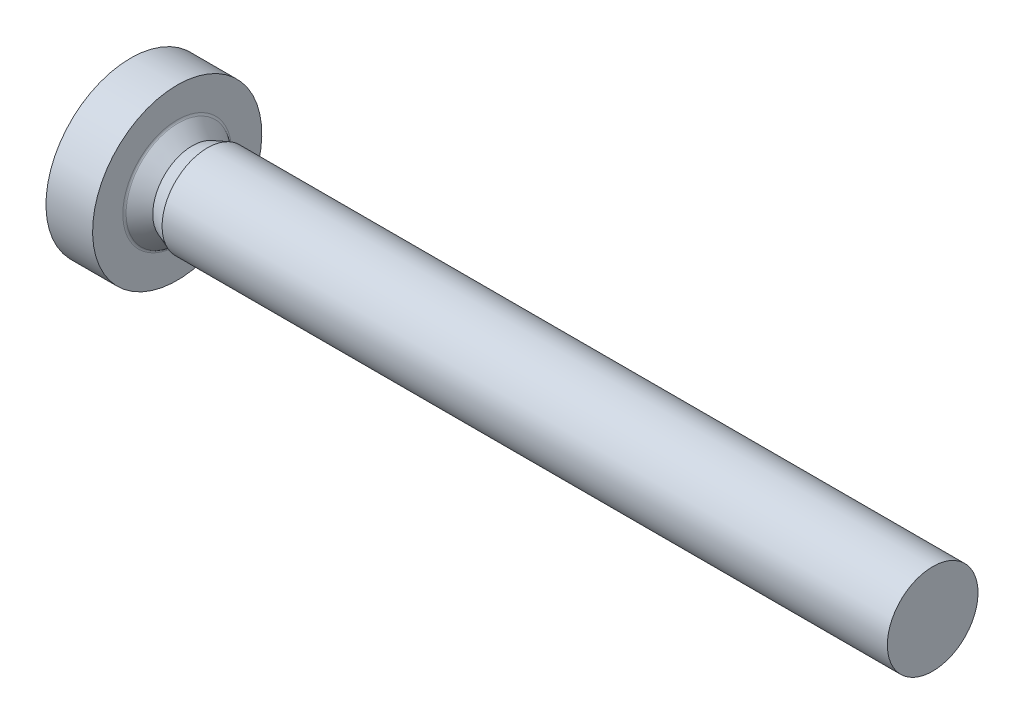
ISO-10303-21;
HEADER;
FILE_DESCRIPTION(('STEP AP214'),'2;1');
FILE_NAME('part.step','',(''),(''),'','','');
FILE_SCHEMA(('AUTOMOTIVE_DESIGN { 1 0 10303 214 1 1 1 1 }'));
ENDSEC;
DATA;
#1=APPLICATION_CONTEXT('core data for automotive mechanical design processes');
#2=APPLICATION_PROTOCOL_DEFINITION('international standard','automotive_design',2000,#1);
#3=PRODUCT_CONTEXT('',#1,'mechanical');
#4=PRODUCT('Part','Part','',(#3));
#5=PRODUCT_RELATED_PRODUCT_CATEGORY('part','',(#4));
#6=PRODUCT_DEFINITION_FORMATION('','',#4);
#7=PRODUCT_DEFINITION_CONTEXT('part definition',#1,'design');
#8=PRODUCT_DEFINITION('design','',#6,#7);
#9=PRODUCT_DEFINITION_SHAPE('','',#8);
#10=(LENGTH_UNIT() NAMED_UNIT(*) SI_UNIT(.MILLI.,.METRE.));
#11=(NAMED_UNIT(*) PLANE_ANGLE_UNIT() SI_UNIT($,.RADIAN.));
#12=(NAMED_UNIT(*) SI_UNIT($,.STERADIAN.) SOLID_ANGLE_UNIT());
#13=UNCERTAINTY_MEASURE_WITH_UNIT(LENGTH_MEASURE(1.E-05),#10,'distance_accuracy_value','');
#14=(GEOMETRIC_REPRESENTATION_CONTEXT(3) GLOBAL_UNCERTAINTY_ASSIGNED_CONTEXT((#13)) GLOBAL_UNIT_ASSIGNED_CONTEXT((#10,
#11,#12)) REPRESENTATION_CONTEXT('',''));
#15=CARTESIAN_POINT('',(0.,0.,0.));
#16=DIRECTION('',(0.,0.,1.));
#17=DIRECTION('',(1.,0.,0.));
#18=AXIS2_PLACEMENT_3D('',#15,#16,#17);
#19=CARTESIAN_POINT('',(25.,0.75,0.));
#20=DIRECTION('',(1.,0.,0.));
#21=DIRECTION('',(0.,1.,0.));
#22=AXIS2_PLACEMENT_3D('',#19,#20,#21);
#23=PLANE('',#22);
#24=CARTESIAN_POINT('',(25.,0.,0.));
#25=DIRECTION('',(1.,0.,0.));
#26=DIRECTION('',(0.,1.,0.));
#27=AXIS2_PLACEMENT_3D('',#24,#25,#26);
#28=CIRCLE('',#27,1.5);
#29=CARTESIAN_POINT('',(25.,1.5,0.));
#30=VERTEX_POINT('',#29);
#31=EDGE_CURVE('E11',#30,#30,#28,.T.);
#32=ORIENTED_EDGE('',*,*,#31,.T.);
#33=EDGE_LOOP('',(#32));
#34=FACE_BOUND('',#33,.T.);
#35=ADVANCED_FACE('F16',(#34),#23,.T.);
#36=CARTESIAN_POINT('',(13.,0.,0.));
#37=DIRECTION('',(-1.,0.,0.));
#38=DIRECTION('',(0.,1.,0.));
#39=AXIS2_PLACEMENT_3D('',#36,#37,#38);
#40=CYLINDRICAL_SURFACE('',#39,1.5);
#41=CARTESIAN_POINT('',(1.,0.,0.));
#42=DIRECTION('',(1.,0.,0.));
#43=DIRECTION('',(0.,1.,0.));
#44=AXIS2_PLACEMENT_3D('',#41,#42,#43);
#45=CIRCLE('',#44,1.5);
#46=CARTESIAN_POINT('',(1.,1.5,0.));
#47=VERTEX_POINT('',#46);
#48=EDGE_CURVE('E26',#47,#47,#45,.T.);
#49=ORIENTED_EDGE('',*,*,#48,.T.);
#50=EDGE_LOOP('',(#49));
#51=FACE_BOUND('',#50,.T.);
#52=ORIENTED_EDGE('',*,*,#31,.F.);
#53=EDGE_LOOP('',(#52));
#54=FACE_BOUND('',#53,.T.);
#55=ADVANCED_FACE('F393',(#51,#54),#40,.T.);
#56=CARTESIAN_POINT('',(0.75,0.,0.));
#57=DIRECTION('',(1.,0.,0.));
#58=DIRECTION('',(0.,1.,0.));
#59=AXIS2_PLACEMENT_3D('',#56,#57,#58);
#60=CONICAL_SURFACE('',#59,1.404375,0.365329745380521);
#61=CARTESIAN_POINT('',(0.5,0.,0.));
#62=DIRECTION('',(1.,0.,0.));
#63=DIRECTION('',(0.,1.,0.));
#64=AXIS2_PLACEMENT_3D('',#61,#62,#63);
#65=CIRCLE('',#64,1.30875);
#66=CARTESIAN_POINT('',(0.5,1.30875,0.));
#67=VERTEX_POINT('',#66);
#68=EDGE_CURVE('E268',#67,#67,#65,.T.);
#69=ORIENTED_EDGE('',*,*,#68,.T.);
#70=EDGE_LOOP('',(#69));
#71=FACE_BOUND('',#70,.T.);
#72=ORIENTED_EDGE('',*,*,#48,.F.);
#73=EDGE_LOOP('',(#72));
#74=FACE_BOUND('',#73,.T.);
#75=ADVANCED_FACE('F388',(#71,#74),#60,.T.);
#76=CARTESIAN_POINT('',(0.266697090928547,0.,0.));
#77=DIRECTION('',(-1.,0.,0.));
#78=DIRECTION('',(0.,1.,0.));
#79=AXIS2_PLACEMENT_3D('',#76,#77,#78);
#80=CONICAL_SURFACE('',#79,1.51708001042528,0.728911585355214);
#81=CARTESIAN_POINT('',(0.0333941818570964,0.,0.));
#82=DIRECTION('',(1.,0.,0.));
#83=DIRECTION('',(0.,1.,0.));
#84=AXIS2_PLACEMENT_3D('',#81,#82,#83);
#85=CIRCLE('',#84,1.72541002085056);
#86=CARTESIAN_POINT('',(0.0333941818570951,1.72541002085056,0.));
#87=VERTEX_POINT('',#86);
#88=EDGE_CURVE('E265',#87,#87,#85,.T.);
#89=ORIENTED_EDGE('',*,*,#88,.T.);
#90=EDGE_LOOP('',(#89));
#91=FACE_BOUND('',#90,.T.);
#92=ORIENTED_EDGE('',*,*,#68,.F.);
#93=EDGE_LOOP('',(#92));
#94=FACE_BOUND('',#93,.T.);
#95=ADVANCED_FACE('F372',(#91,#94),#80,.T.);
#96=CARTESIAN_POINT('',(0.1,0.,0.));
#97=DIRECTION('',(1.,0.,0.));
#98=DIRECTION('',(0.,0.,-1.));
#99=AXIS2_PLACEMENT_3D('',#96,#97,#98);
#100=TOROIDAL_SURFACE('',#99,1.8,0.1);
#101=CARTESIAN_POINT('',(0.,0.,0.));
#102=DIRECTION('',(1.,0.,0.));
#103=DIRECTION('',(0.,1.,0.));
#104=AXIS2_PLACEMENT_3D('',#101,#102,#103);
#105=CIRCLE('',#104,1.8);
#106=CARTESIAN_POINT('',(0.,1.8,0.));
#107=VERTEX_POINT('',#106);
#108=EDGE_CURVE('E269',#107,#107,#105,.T.);
#109=ORIENTED_EDGE('',*,*,#108,.T.);
#110=EDGE_LOOP('',(#109));
#111=FACE_BOUND('',#110,.T.);
#112=ORIENTED_EDGE('',*,*,#88,.F.);
#113=EDGE_LOOP('',(#112));
#114=FACE_BOUND('',#113,.T.);
#115=ADVANCED_FACE('F375',(#111,#114),#100,.F.);
#116=CARTESIAN_POINT('',(0.,2.3,0.));
#117=DIRECTION('',(1.,0.,0.));
#118=DIRECTION('',(0.,1.,0.));
#119=AXIS2_PLACEMENT_3D('',#116,#117,#118);
#120=PLANE('',#119);
#121=CARTESIAN_POINT('',(0.,0.,0.));
#122=DIRECTION('',(1.,0.,0.));
#123=DIRECTION('',(0.,1.,0.));
#124=AXIS2_PLACEMENT_3D('',#121,#122,#123);
#125=CIRCLE('',#124,2.8);
#126=CARTESIAN_POINT('',(0.,2.8,0.));
#127=VERTEX_POINT('',#126);
#128=EDGE_CURVE('E286',#127,#127,#125,.T.);
#129=ORIENTED_EDGE('',*,*,#128,.T.);
#130=EDGE_LOOP('',(#129));
#131=FACE_BOUND('',#130,.T.);
#132=ORIENTED_EDGE('',*,*,#108,.F.);
#133=EDGE_LOOP('',(#132));
#134=FACE_BOUND('',#133,.T.);
#135=ADVANCED_FACE('F377',(#131,#134),#120,.T.);
#136=CARTESIAN_POINT('',(-0.771231517720798,0.,0.));
#137=DIRECTION('',(-1.,0.,0.));
#138=DIRECTION('',(0.,1.,0.));
#139=AXIS2_PLACEMENT_3D('',#136,#137,#138);
#140=CYLINDRICAL_SURFACE('',#139,2.8);
#141=CARTESIAN_POINT('',(-1.54246303544159,0.,0.));
#142=DIRECTION('',(1.,0.,0.));
#143=DIRECTION('',(0.,1.,0.));
#144=AXIS2_PLACEMENT_3D('',#141,#142,#143);
#145=CIRCLE('',#144,2.8);
#146=CARTESIAN_POINT('',(-1.54246303544159,2.8,0.));
#147=VERTEX_POINT('',#146);
#148=EDGE_CURVE('E284',#147,#147,#145,.T.);
#149=ORIENTED_EDGE('',*,*,#148,.T.);
#150=EDGE_LOOP('',(#149));
#151=FACE_BOUND('',#150,.T.);
#152=ORIENTED_EDGE('',*,*,#128,.F.);
#153=EDGE_LOOP('',(#152));
#154=FACE_BOUND('',#153,.T.);
#155=ADVANCED_FACE('F385',(#151,#154),#140,.T.);
#156=CARTESIAN_POINT('',(2.6,0.,0.));
#157=DIRECTION('',(0.,0.,1.));
#158=DIRECTION('',(1.,0.,0.));
#159=AXIS2_PLACEMENT_3D('',#156,#157,#158);
#160=SPHERICAL_SURFACE('',#159,5.);
#161=ORIENTED_EDGE('',*,*,#148,.F.);
#162=EDGE_LOOP('',(#161));
#163=FACE_BOUND('',#162,.T.);
#164=CARTESIAN_POINT('',(2.6,1.5,0.));
#165=DIRECTION('',(0.,1.,0.));
#166=DIRECTION('',(0.,0.,-1.));
#167=AXIS2_PLACEMENT_3D('',#164,#165,#166);
#168=CIRCLE('',#167,4.76969600708473);
#169=CARTESIAN_POINT('',(-2.16025209416476,1.5,-0.3));
#170=VERTEX_POINT('',#169);
#171=CARTESIAN_POINT('',(-2.16025209416476,1.5,0.3));
#172=VERTEX_POINT('',#171);
#173=EDGE_CURVE('E283',#170,#172,#168,.T.);
#174=ORIENTED_EDGE('',*,*,#173,.T.);
#175=CARTESIAN_POINT('',(2.6,-0.0146530414091956,0.167485029701634));
#176=DIRECTION('',(0.,-0.0871557427476582,0.996194698091746));
#177=DIRECTION('',(0.,0.996194698091746,0.0871557427476581));
#178=AXIS2_PLACEMENT_3D('',#175,#176,#177);
#179=CIRCLE('',#178,4.99717260590459);
#180=CARTESIAN_POINT('',(-2.35893576512593,0.6,0.221260202826669));
#181=VERTEX_POINT('',#180);
#182=EDGE_CURVE('E222',#172,#181,#179,.T.);
#183=ORIENTED_EDGE('',*,*,#182,.T.);
#184=CARTESIAN_POINT('',(2.6,0.245808478247197,0.425752773255334));
#185=DIRECTION('',(0.,0.5,0.866025403784438));
#186=DIRECTION('',(0.,0.866025403784438,-0.5));
#187=AXIS2_PLACEMENT_3D('',#184,#185,#186);
#188=CIRCLE('',#187,4.97577258002083);
#189=CARTESIAN_POINT('',(-2.374028589137,0.359888590016273,0.359888590016274));
#190=VERTEX_POINT('',#189);
#191=EDGE_CURVE('E228',#181,#190,#188,.T.);
#192=ORIENTED_EDGE('',*,*,#191,.T.);
#193=CARTESIAN_POINT('',(2.6,0.425752773255333,0.245808478247197));
#194=DIRECTION('',(0.,0.866025403784439,0.5));
#195=DIRECTION('',(0.,0.5,-0.866025403784439));
#196=AXIS2_PLACEMENT_3D('',#193,#194,#195);
#197=CIRCLE('',#196,4.97577258002083);
#198=CARTESIAN_POINT('',(-2.35893576512593,0.221260202826669,0.6));
#199=VERTEX_POINT('',#198);
#200=EDGE_CURVE('E211',#190,#199,#197,.T.);
#201=ORIENTED_EDGE('',*,*,#200,.T.);
#202=CARTESIAN_POINT('',(2.6,0.167485029701634,-0.0146530414091956));
#203=DIRECTION('',(0.,0.996194698091746,-0.0871557427476583));
#204=DIRECTION('',(0.,-0.0871557427476583,-0.996194698091746));
#205=AXIS2_PLACEMENT_3D('',#202,#203,#204);
#206=CIRCLE('',#205,4.99717260590459);
#207=CARTESIAN_POINT('',(-2.16025209416476,0.3,1.5));
#208=VERTEX_POINT('',#207);
#209=EDGE_CURVE('E212',#199,#208,#206,.T.);
#210=ORIENTED_EDGE('',*,*,#209,.T.);
#211=CARTESIAN_POINT('',(2.6,0.,1.5));
#212=DIRECTION('',(0.,0.,1.));
#213=DIRECTION('',(0.,1.,0.));
#214=AXIS2_PLACEMENT_3D('',#211,#212,#213);
#215=CIRCLE('',#214,4.76969600708473);
#216=CARTESIAN_POINT('',(-2.16025209416476,-0.3,1.5));
#217=VERTEX_POINT('',#216);
#218=EDGE_CURVE('E258',#208,#217,#215,.T.);
#219=ORIENTED_EDGE('',*,*,#218,.T.);
#220=CARTESIAN_POINT('',(2.6,-0.167485029701634,-0.0146530414091956));
#221=DIRECTION('',(0.,-0.996194698091746,-0.0871557427476581));
#222=DIRECTION('',(0.,-0.0871557427476581,0.996194698091746));
#223=AXIS2_PLACEMENT_3D('',#220,#221,#222);
#224=CIRCLE('',#223,4.99717260590459);
#225=CARTESIAN_POINT('',(-2.35893576512593,-0.221260202826669,0.6));
#226=VERTEX_POINT('',#225);
#227=EDGE_CURVE('E257',#217,#226,#224,.T.);
#228=ORIENTED_EDGE('',*,*,#227,.T.);
#229=CARTESIAN_POINT('',(2.6,-0.425752773255333,0.245808478247197));
#230=DIRECTION('',(0.,-0.866025403784439,0.5));
#231=DIRECTION('',(0.,0.5,0.866025403784439));
#232=AXIS2_PLACEMENT_3D('',#229,#230,#231);
#233=CIRCLE('',#232,4.97577258002083);
#234=CARTESIAN_POINT('',(-2.374028589137,-0.359888590016273,0.359888590016274));
#235=VERTEX_POINT('',#234);
#236=EDGE_CURVE('E179',#226,#235,#233,.T.);
#237=ORIENTED_EDGE('',*,*,#236,.T.);
#238=CARTESIAN_POINT('',(2.6,-0.245808478247197,0.425752773255334));
#239=DIRECTION('',(0.,-0.5,0.866025403784439));
#240=DIRECTION('',(0.,0.866025403784439,0.5));
#241=AXIS2_PLACEMENT_3D('',#238,#239,#240);
#242=CIRCLE('',#241,4.97577258002083);
#243=CARTESIAN_POINT('',(-2.35893576512593,-0.6,0.221260202826669));
#244=VERTEX_POINT('',#243);
#245=EDGE_CURVE('E170',#235,#244,#242,.T.);
#246=ORIENTED_EDGE('',*,*,#245,.T.);
#247=CARTESIAN_POINT('',(2.6,0.0146530414091956,0.167485029701634));
#248=DIRECTION('',(0.,0.0871557427476581,0.996194698091746));
#249=DIRECTION('',(0.,0.996194698091746,-0.0871557427476581));
#250=AXIS2_PLACEMENT_3D('',#247,#248,#249);
#251=CIRCLE('',#250,4.99717260590459);
#252=CARTESIAN_POINT('',(-2.16025209416476,-1.5,0.3));
#253=VERTEX_POINT('',#252);
#254=EDGE_CURVE('E176',#244,#253,#251,.T.);
#255=ORIENTED_EDGE('',*,*,#254,.T.);
#256=CARTESIAN_POINT('',(2.6,-1.5,0.));
#257=DIRECTION('',(0.,-1.,0.));
#258=DIRECTION('',(0.,0.,1.));
#259=AXIS2_PLACEMENT_3D('',#256,#257,#258);
#260=CIRCLE('',#259,4.76969600708473);
#261=CARTESIAN_POINT('',(-2.16025209416476,-1.5,-0.3));
#262=VERTEX_POINT('',#261);
#263=EDGE_CURVE('E350',#253,#262,#260,.T.);
#264=ORIENTED_EDGE('',*,*,#263,.T.);
#265=CARTESIAN_POINT('',(2.6,0.0146530414091956,-0.167485029701634));
#266=DIRECTION('',(0.,0.087155742747658,-0.996194698091746));
#267=DIRECTION('',(0.,-0.996194698091746,-0.087155742747658));
#268=AXIS2_PLACEMENT_3D('',#265,#266,#267);
#269=CIRCLE('',#268,4.99717260590459);
#270=CARTESIAN_POINT('',(-2.35893576512593,-0.6,-0.221260202826669));
#271=VERTEX_POINT('',#270);
#272=EDGE_CURVE('E274',#262,#271,#269,.T.);
#273=ORIENTED_EDGE('',*,*,#272,.T.);
#274=CARTESIAN_POINT('',(2.6,-0.245808478247196,-0.425752773255333));
#275=DIRECTION('',(0.,-0.5,-0.866025403784439));
#276=DIRECTION('',(0.,-0.866025403784439,0.5));
#277=AXIS2_PLACEMENT_3D('',#274,#275,#276);
#278=CIRCLE('',#277,4.97577258002083);
#279=CARTESIAN_POINT('',(-2.374028589137,-0.359888590016273,-0.359888590016273));
#280=VERTEX_POINT('',#279);
#281=EDGE_CURVE('E251',#271,#280,#278,.T.);
#282=ORIENTED_EDGE('',*,*,#281,.T.);
#283=CARTESIAN_POINT('',(2.6,-0.425752773255333,-0.245808478247196));
#284=DIRECTION('',(0.,-0.866025403784439,-0.5));
#285=DIRECTION('',(0.,-0.5,0.866025403784439));
#286=AXIS2_PLACEMENT_3D('',#283,#284,#285);
#287=CIRCLE('',#286,4.97577258002083);
#288=CARTESIAN_POINT('',(-2.35893576512593,-0.221260202826669,-0.6));
#289=VERTEX_POINT('',#288);
#290=EDGE_CURVE('E299',#280,#289,#287,.T.);
#291=ORIENTED_EDGE('',*,*,#290,.T.);
#292=CARTESIAN_POINT('',(2.6,-0.167485029701634,0.0146530414091956));
#293=DIRECTION('',(0.,-0.996194698091746,0.0871557427476582));
#294=DIRECTION('',(0.,0.0871557427476582,0.996194698091746));
#295=AXIS2_PLACEMENT_3D('',#292,#293,#294);
#296=CIRCLE('',#295,4.99717260590459);
#297=CARTESIAN_POINT('',(-2.16025209416476,-0.3,-1.5));
#298=VERTEX_POINT('',#297);
#299=EDGE_CURVE('E90',#289,#298,#296,.T.);
#300=ORIENTED_EDGE('',*,*,#299,.T.);
#301=CARTESIAN_POINT('',(2.6,0.,-1.5));
#302=DIRECTION('',(0.,0.,-1.));
#303=DIRECTION('',(0.,-1.,0.));
#304=AXIS2_PLACEMENT_3D('',#301,#302,#303);
#305=CIRCLE('',#304,4.76969600708473);
#306=CARTESIAN_POINT('',(-2.16025209416476,0.3,-1.5));
#307=VERTEX_POINT('',#306);
#308=EDGE_CURVE('E313',#298,#307,#305,.T.);
#309=ORIENTED_EDGE('',*,*,#308,.T.);
#310=CARTESIAN_POINT('',(2.6,0.167485029701634,0.0146530414091956));
#311=DIRECTION('',(0.,0.996194698091746,0.0871557427476582));
#312=DIRECTION('',(0.,0.0871557427476582,-0.996194698091746));
#313=AXIS2_PLACEMENT_3D('',#310,#311,#312);
#314=CIRCLE('',#313,4.99717260590459);
#315=CARTESIAN_POINT('',(-2.35893576512593,0.221260202826669,-0.6));
#316=VERTEX_POINT('',#315);
#317=EDGE_CURVE('E238',#307,#316,#314,.T.);
#318=ORIENTED_EDGE('',*,*,#317,.T.);
#319=CARTESIAN_POINT('',(2.6,0.425752773255333,-0.245808478247196));
#320=DIRECTION('',(0.,0.866025403784439,-0.5));
#321=DIRECTION('',(0.,-0.5,-0.866025403784439));
#322=AXIS2_PLACEMENT_3D('',#319,#320,#321);
#323=CIRCLE('',#322,4.97577258002083);
#324=CARTESIAN_POINT('',(-2.374028589137,0.359888590016273,-0.359888590016274));
#325=VERTEX_POINT('',#324);
#326=EDGE_CURVE('E242',#316,#325,#323,.T.);
#327=ORIENTED_EDGE('',*,*,#326,.T.);
#328=CARTESIAN_POINT('',(2.6,0.245808478247196,-0.425752773255333));
#329=DIRECTION('',(0.,0.5,-0.866025403784439));
#330=DIRECTION('',(0.,-0.866025403784439,-0.5));
#331=AXIS2_PLACEMENT_3D('',#328,#329,#330);
#332=CIRCLE('',#331,4.97577258002083);
#333=CARTESIAN_POINT('',(-2.35893576512593,0.6,-0.221260202826669));
#334=VERTEX_POINT('',#333);
#335=EDGE_CURVE('E279',#325,#334,#332,.T.);
#336=ORIENTED_EDGE('',*,*,#335,.T.);
#337=CARTESIAN_POINT('',(2.6,-0.0146530414091956,-0.167485029701633));
#338=DIRECTION('',(0.,-0.0871557427476582,-0.996194698091746));
#339=DIRECTION('',(0.,-0.996194698091746,0.0871557427476582));
#340=AXIS2_PLACEMENT_3D('',#337,#338,#339);
#341=CIRCLE('',#340,4.99717260590459);
#342=EDGE_CURVE('E261',#334,#170,#341,.T.);
#343=ORIENTED_EDGE('',*,*,#342,.T.);
#344=EDGE_LOOP('',(#174,#183,#192,#201,#210,#219,#228,#237,#246,#255,#264,#273,#282,#291,#300,
#309,#318,#327,#336,#343));
#345=FACE_BOUND('',#344,.T.);
#346=ADVANCED_FACE('F173',(#163,#345),#160,.T.);
#347=CARTESIAN_POINT('',(-1.2,0.,0.));
#348=DIRECTION('',(1.,0.,0.));
#349=DIRECTION('',(0.,0.,-1.));
#350=AXIS2_PLACEMENT_3D('',#347,#348,#349);
#351=PLANE('',#350);
#352=DIRECTION('',(0.,0.,-1.));
#353=VECTOR('',#352,1.);
#354=CARTESIAN_POINT('',(-1.2,1.5,-0.3));
#355=LINE('',#354,#353);
#356=CARTESIAN_POINT('',(-1.2,1.5,0.3));
#357=VERTEX_POINT('',#356);
#358=CARTESIAN_POINT('',(-1.2,1.5,-0.3));
#359=VERTEX_POINT('',#358);
#360=EDGE_CURVE('E201',#357,#359,#355,.T.);
#361=ORIENTED_EDGE('',*,*,#360,.T.);
#362=DIRECTION('',(0.,-0.996194698091746,0.0871557427476582));
#363=VECTOR('',#362,1.);
#364=CARTESIAN_POINT('',(-1.2,1.5,-0.3));
#365=LINE('',#364,#363);
#366=CARTESIAN_POINT('',(-1.2,0.6,-0.221260202826669));
#367=VERTEX_POINT('',#366);
#368=EDGE_CURVE('E264',#359,#367,#365,.T.);
#369=ORIENTED_EDGE('',*,*,#368,.T.);
#370=DIRECTION('',(0.,-0.866025403784439,-0.5));
#371=VECTOR('',#370,1.);
#372=CARTESIAN_POINT('',(-1.2,0.6,-0.221260202826669));
#373=LINE('',#372,#371);
#374=CARTESIAN_POINT('',(-1.2,0.359888590016273,-0.359888590016273));
#375=VERTEX_POINT('',#374);
#376=EDGE_CURVE('E277',#367,#375,#373,.T.);
#377=ORIENTED_EDGE('',*,*,#376,.T.);
#378=DIRECTION('',(0.,-0.5,-0.866025403784439));
#379=VECTOR('',#378,1.);
#380=CARTESIAN_POINT('',(-1.2,0.221260202826669,-0.6));
#381=LINE('',#380,#379);
#382=CARTESIAN_POINT('',(-1.2,0.221260202826669,-0.6));
#383=VERTEX_POINT('',#382);
#384=EDGE_CURVE('E294',#375,#383,#381,.T.);
#385=ORIENTED_EDGE('',*,*,#384,.T.);
#386=DIRECTION('',(0.,0.0871557427476582,-0.996194698091746));
#387=VECTOR('',#386,1.);
#388=CARTESIAN_POINT('',(-1.2,0.3,-1.5));
#389=LINE('',#388,#387);
#390=CARTESIAN_POINT('',(-1.2,0.3,-1.5));
#391=VERTEX_POINT('',#390);
#392=EDGE_CURVE('E236',#383,#391,#389,.T.);
#393=ORIENTED_EDGE('',*,*,#392,.T.);
#394=DIRECTION('',(0.,-1.,0.));
#395=VECTOR('',#394,1.);
#396=CARTESIAN_POINT('',(-1.2,-0.3,-1.5));
#397=LINE('',#396,#395);
#398=CARTESIAN_POINT('',(-1.2,-0.3,-1.5));
#399=VERTEX_POINT('',#398);
#400=EDGE_CURVE('E248',#391,#399,#397,.T.);
#401=ORIENTED_EDGE('',*,*,#400,.T.);
#402=DIRECTION('',(0.,0.0871557427476582,0.996194698091746));
#403=VECTOR('',#402,1.);
#404=CARTESIAN_POINT('',(-1.2,-0.3,-1.5));
#405=LINE('',#404,#403);
#406=CARTESIAN_POINT('',(-1.2,-0.221260202826669,-0.6));
#407=VERTEX_POINT('',#406);
#408=EDGE_CURVE('E79',#399,#407,#405,.T.);
#409=ORIENTED_EDGE('',*,*,#408,.T.);
#410=DIRECTION('',(0.,-0.5,0.866025403784439));
#411=VECTOR('',#410,1.);
#412=CARTESIAN_POINT('',(-1.2,-0.221260202826669,-0.6));
#413=LINE('',#412,#411);
#414=CARTESIAN_POINT('',(-1.2,-0.359888590016273,-0.359888590016273));
#415=VERTEX_POINT('',#414);
#416=EDGE_CURVE('E302',#407,#415,#413,.T.);
#417=ORIENTED_EDGE('',*,*,#416,.T.);
#418=DIRECTION('',(0.,-0.866025403784439,0.5));
#419=VECTOR('',#418,1.);
#420=CARTESIAN_POINT('',(-1.2,-0.6,-0.221260202826669));
#421=LINE('',#420,#419);
#422=CARTESIAN_POINT('',(-1.2,-0.6,-0.221260202826669));
#423=VERTEX_POINT('',#422);
#424=EDGE_CURVE('E306',#415,#423,#421,.T.);
#425=ORIENTED_EDGE('',*,*,#424,.T.);
#426=DIRECTION('',(0.,-0.996194698091746,-0.087155742747658));
#427=VECTOR('',#426,1.);
#428=CARTESIAN_POINT('',(-1.2,-1.5,-0.3));
#429=LINE('',#428,#427);
#430=CARTESIAN_POINT('',(-1.2,-1.5,-0.3));
#431=VERTEX_POINT('',#430);
#432=EDGE_CURVE('E321',#423,#431,#429,.T.);
#433=ORIENTED_EDGE('',*,*,#432,.T.);
#434=DIRECTION('',(0.,0.,1.));
#435=VECTOR('',#434,1.);
#436=CARTESIAN_POINT('',(-1.2,-1.5,0.3));
#437=LINE('',#436,#435);
#438=CARTESIAN_POINT('',(-1.2,-1.5,0.3));
#439=VERTEX_POINT('',#438);
#440=EDGE_CURVE('E275',#431,#439,#437,.T.);
#441=ORIENTED_EDGE('',*,*,#440,.T.);
#442=DIRECTION('',(0.,0.996194698091746,-0.0871557427476581));
#443=VECTOR('',#442,1.);
#444=CARTESIAN_POINT('',(-1.2,-1.5,0.3));
#445=LINE('',#444,#443);
#446=CARTESIAN_POINT('',(-1.2,-0.6,0.221260202826669));
#447=VERTEX_POINT('',#446);
#448=EDGE_CURVE('E184',#439,#447,#445,.T.);
#449=ORIENTED_EDGE('',*,*,#448,.T.);
#450=DIRECTION('',(0.,0.866025403784439,0.5));
#451=VECTOR('',#450,1.);
#452=CARTESIAN_POINT('',(-1.2,-0.6,0.221260202826669));
#453=LINE('',#452,#451);
#454=CARTESIAN_POINT('',(-1.2,-0.359888590016273,0.359888590016274));
#455=VERTEX_POINT('',#454);
#456=EDGE_CURVE('E190',#447,#455,#453,.T.);
#457=ORIENTED_EDGE('',*,*,#456,.T.);
#458=DIRECTION('',(0.,0.5,0.866025403784439));
#459=VECTOR('',#458,1.);
#460=CARTESIAN_POINT('',(-1.2,-0.221260202826669,0.6));
#461=LINE('',#460,#459);
#462=CARTESIAN_POINT('',(-1.2,-0.221260202826669,0.6));
#463=VERTEX_POINT('',#462);
#464=EDGE_CURVE('E219',#455,#463,#461,.T.);
#465=ORIENTED_EDGE('',*,*,#464,.T.);
#466=DIRECTION('',(0.,-0.0871557427476581,0.996194698091746));
#467=VECTOR('',#466,1.);
#468=CARTESIAN_POINT('',(-1.2,-0.3,1.5));
#469=LINE('',#468,#467);
#470=CARTESIAN_POINT('',(-1.2,-0.3,1.5));
#471=VERTEX_POINT('',#470);
#472=EDGE_CURVE('E256',#463,#471,#469,.T.);
#473=ORIENTED_EDGE('',*,*,#472,.T.);
#474=DIRECTION('',(0.,1.,0.));
#475=VECTOR('',#474,1.);
#476=CARTESIAN_POINT('',(-1.2,0.3,1.5));
#477=LINE('',#476,#475);
#478=CARTESIAN_POINT('',(-1.2,0.3,1.5));
#479=VERTEX_POINT('',#478);
#480=EDGE_CURVE('E216',#471,#479,#477,.T.);
#481=ORIENTED_EDGE('',*,*,#480,.T.);
#482=DIRECTION('',(0.,-0.0871557427476583,-0.996194698091746));
#483=VECTOR('',#482,1.);
#484=CARTESIAN_POINT('',(-1.2,0.3,1.5));
#485=LINE('',#484,#483);
#486=CARTESIAN_POINT('',(-1.2,0.221260202826669,0.6));
#487=VERTEX_POINT('',#486);
#488=EDGE_CURVE('E296',#479,#487,#485,.T.);
#489=ORIENTED_EDGE('',*,*,#488,.T.);
#490=DIRECTION('',(0.,0.5,-0.866025403784439));
#491=VECTOR('',#490,1.);
#492=CARTESIAN_POINT('',(-1.2,0.221260202826669,0.6));
#493=LINE('',#492,#491);
#494=CARTESIAN_POINT('',(-1.2,0.359888590016273,0.359888590016274));
#495=VERTEX_POINT('',#494);
#496=EDGE_CURVE('E210',#487,#495,#493,.T.);
#497=ORIENTED_EDGE('',*,*,#496,.T.);
#498=DIRECTION('',(0.,0.866025403784438,-0.5));
#499=VECTOR('',#498,1.);
#500=CARTESIAN_POINT('',(-1.2,0.6,0.221260202826669));
#501=LINE('',#500,#499);
#502=CARTESIAN_POINT('',(-1.2,0.6,0.221260202826669));
#503=VERTEX_POINT('',#502);
#504=EDGE_CURVE('E220',#495,#503,#501,.T.);
#505=ORIENTED_EDGE('',*,*,#504,.T.);
#506=DIRECTION('',(0.,0.996194698091746,0.0871557427476582));
#507=VECTOR('',#506,1.);
#508=CARTESIAN_POINT('',(-1.2,1.5,0.3));
#509=LINE('',#508,#507);
#510=EDGE_CURVE('E226',#503,#357,#509,.T.);
#511=ORIENTED_EDGE('',*,*,#510,.T.);
#512=EDGE_LOOP('',(#361,#369,#377,#385,#393,#401,#409,#417,#425,#433,#441,#449,#457,#465,#473,
#481,#489,#497,#505,#511));
#513=FACE_BOUND('',#512,.T.);
#514=ADVANCED_FACE('F323',(#513),#351,.F.);
#515=CARTESIAN_POINT('',(-2.64,1.05,0.260630101413334));
#516=DIRECTION('',(0.,-0.0871557427476581,0.996194698091746));
#517=DIRECTION('',(0.,-0.996194698091746,-0.0871557427476582));
#518=AXIS2_PLACEMENT_3D('',#515,#516,#517);
#519=PLANE('',#518);
#520=ORIENTED_EDGE('',*,*,#182,.F.);
#521=DIRECTION('',(1.,0.,0.));
#522=VECTOR('',#521,1.);
#523=CARTESIAN_POINT('',(-2.64,1.5,0.3));
#524=LINE('',#523,#522);
#525=EDGE_CURVE('E198',#172,#357,#524,.T.);
#526=ORIENTED_EDGE('',*,*,#525,.T.);
#527=ORIENTED_EDGE('',*,*,#510,.F.);
#528=DIRECTION('',(1.,0.,0.));
#529=VECTOR('',#528,1.);
#530=CARTESIAN_POINT('',(-2.64,0.6,0.221260202826669));
#531=LINE('',#530,#529);
#532=EDGE_CURVE('E223',#181,#503,#531,.T.);
#533=ORIENTED_EDGE('',*,*,#532,.F.);
#534=EDGE_LOOP('',(#520,#526,#527,#533));
#535=FACE_BOUND('',#534,.T.);
#536=ADVANCED_FACE('F18',(#535),#519,.F.);
#537=CARTESIAN_POINT('',(-2.64,0.479944295008137,0.290574396421471));
#538=DIRECTION('',(0.,0.5,0.866025403784438));
#539=DIRECTION('',(0.,-0.866025403784438,0.5));
#540=AXIS2_PLACEMENT_3D('',#537,#538,#539);
#541=PLANE('',#540);
#542=ORIENTED_EDGE('',*,*,#191,.F.);
#543=ORIENTED_EDGE('',*,*,#532,.T.);
#544=ORIENTED_EDGE('',*,*,#504,.F.);
#545=DIRECTION('',(1.,0.,0.));
#546=VECTOR('',#545,1.);
#547=CARTESIAN_POINT('',(-2.64,0.359888590016273,0.359888590016273));
#548=LINE('',#547,#546);
#549=EDGE_CURVE('E207',#190,#495,#548,.T.);
#550=ORIENTED_EDGE('',*,*,#549,.F.);
#551=EDGE_LOOP('',(#542,#543,#544,#550));
#552=FACE_BOUND('',#551,.T.);
#553=ADVANCED_FACE('F426',(#552),#541,.F.);
#554=CARTESIAN_POINT('',(-2.64,0.290574396421471,0.479944295008137));
#555=DIRECTION('',(0.,0.866025403784439,0.5));
#556=DIRECTION('',(0.,-0.5,0.866025403784439));
#557=AXIS2_PLACEMENT_3D('',#554,#555,#556);
#558=PLANE('',#557);
#559=ORIENTED_EDGE('',*,*,#200,.F.);
#560=ORIENTED_EDGE('',*,*,#549,.T.);
#561=ORIENTED_EDGE('',*,*,#496,.F.);
#562=DIRECTION('',(1.,0.,0.));
#563=VECTOR('',#562,1.);
#564=CARTESIAN_POINT('',(-2.64,0.221260202826669,0.6));
#565=LINE('',#564,#563);
#566=EDGE_CURVE('E215',#199,#487,#565,.T.);
#567=ORIENTED_EDGE('',*,*,#566,.F.);
#568=EDGE_LOOP('',(#559,#560,#561,#567));
#569=FACE_BOUND('',#568,.T.);
#570=ADVANCED_FACE('F419',(#569),#558,.F.);
#571=CARTESIAN_POINT('',(-2.64,0.260630101413335,1.05));
#572=DIRECTION('',(0.,0.996194698091746,-0.0871557427476583));
#573=DIRECTION('',(0.,0.0871557427476583,0.996194698091746));
#574=AXIS2_PLACEMENT_3D('',#571,#572,#573);
#575=PLANE('',#574);
#576=ORIENTED_EDGE('',*,*,#209,.F.);
#577=ORIENTED_EDGE('',*,*,#566,.T.);
#578=ORIENTED_EDGE('',*,*,#488,.F.);
#579=DIRECTION('',(1.,0.,0.));
#580=VECTOR('',#579,1.);
#581=CARTESIAN_POINT('',(-2.64,0.3,1.5));
#582=LINE('',#581,#580);
#583=EDGE_CURVE('E260',#208,#479,#582,.T.);
#584=ORIENTED_EDGE('',*,*,#583,.F.);
#585=EDGE_LOOP('',(#576,#577,#578,#584));
#586=FACE_BOUND('',#585,.T.);
#587=ADVANCED_FACE('F415',(#586),#575,.F.);
#588=CARTESIAN_POINT('',(-2.64,0.,1.5));
#589=DIRECTION('',(0.,0.,1.));
#590=DIRECTION('',(0.,-1.,0.));
#591=AXIS2_PLACEMENT_3D('',#588,#589,#590);
#592=PLANE('',#591);
#593=ORIENTED_EDGE('',*,*,#218,.F.);
#594=ORIENTED_EDGE('',*,*,#583,.T.);
#595=ORIENTED_EDGE('',*,*,#480,.F.);
#596=DIRECTION('',(1.,0.,0.));
#597=VECTOR('',#596,1.);
#598=CARTESIAN_POINT('',(-2.64,-0.3,1.5));
#599=LINE('',#598,#597);
#600=EDGE_CURVE('E253',#217,#471,#599,.T.);
#601=ORIENTED_EDGE('',*,*,#600,.F.);
#602=EDGE_LOOP('',(#593,#594,#595,#601));
#603=FACE_BOUND('',#602,.T.);
#604=ADVANCED_FACE('F418',(#603),#592,.F.);
#605=CARTESIAN_POINT('',(-2.64,-0.260630101413334,1.05));
#606=DIRECTION('',(0.,-0.996194698091746,-0.0871557427476581));
#607=DIRECTION('',(0.,0.0871557427476581,-0.996194698091746));
#608=AXIS2_PLACEMENT_3D('',#605,#606,#607);
#609=PLANE('',#608);
#610=ORIENTED_EDGE('',*,*,#227,.F.);
#611=ORIENTED_EDGE('',*,*,#600,.T.);
#612=ORIENTED_EDGE('',*,*,#472,.F.);
#613=DIRECTION('',(1.,0.,0.));
#614=VECTOR('',#613,1.);
#615=CARTESIAN_POINT('',(-2.64,-0.221260202826669,0.6));
#616=LINE('',#615,#614);
#617=EDGE_CURVE('E217',#226,#463,#616,.T.);
#618=ORIENTED_EDGE('',*,*,#617,.F.);
#619=EDGE_LOOP('',(#610,#611,#612,#618));
#620=FACE_BOUND('',#619,.T.);
#621=ADVANCED_FACE('F424',(#620),#609,.F.);
#622=CARTESIAN_POINT('',(-2.64,-0.290574396421471,0.479944295008137));
#623=DIRECTION('',(0.,-0.866025403784439,0.5));
#624=DIRECTION('',(0.,-0.5,-0.866025403784439));
#625=AXIS2_PLACEMENT_3D('',#622,#623,#624);
#626=PLANE('',#625);
#627=ORIENTED_EDGE('',*,*,#236,.F.);
#628=ORIENTED_EDGE('',*,*,#617,.T.);
#629=ORIENTED_EDGE('',*,*,#464,.F.);
#630=DIRECTION('',(1.,0.,0.));
#631=VECTOR('',#630,1.);
#632=CARTESIAN_POINT('',(-2.64,-0.359888590016273,0.359888590016274));
#633=LINE('',#632,#631);
#634=EDGE_CURVE('E183',#235,#455,#633,.T.);
#635=ORIENTED_EDGE('',*,*,#634,.F.);
#636=EDGE_LOOP('',(#627,#628,#629,#635));
#637=FACE_BOUND('',#636,.T.);
#638=ADVANCED_FACE('F421',(#637),#626,.F.);
#639=CARTESIAN_POINT('',(-2.64,-0.479944295008137,0.290574396421471));
#640=DIRECTION('',(0.,-0.5,0.866025403784439));
#641=DIRECTION('',(0.,-0.866025403784439,-0.5));
#642=AXIS2_PLACEMENT_3D('',#639,#640,#641);
#643=PLANE('',#642);
#644=ORIENTED_EDGE('',*,*,#245,.F.);
#645=ORIENTED_EDGE('',*,*,#634,.T.);
#646=ORIENTED_EDGE('',*,*,#456,.F.);
#647=DIRECTION('',(1.,0.,0.));
#648=VECTOR('',#647,1.);
#649=CARTESIAN_POINT('',(-2.64,-0.6,0.221260202826669));
#650=LINE('',#649,#648);
#651=EDGE_CURVE('E187',#244,#447,#650,.T.);
#652=ORIENTED_EDGE('',*,*,#651,.F.);
#653=EDGE_LOOP('',(#644,#645,#646,#652));
#654=FACE_BOUND('',#653,.T.);
#655=ADVANCED_FACE('F188',(#654),#643,.F.);
#656=CARTESIAN_POINT('',(-2.64,-1.05,0.260630101413335));
#657=DIRECTION('',(0.,0.0871557427476581,0.996194698091746));
#658=DIRECTION('',(0.,-0.996194698091746,0.0871557427476581));
#659=AXIS2_PLACEMENT_3D('',#656,#657,#658);
#660=PLANE('',#659);
#661=ORIENTED_EDGE('',*,*,#254,.F.);
#662=ORIENTED_EDGE('',*,*,#651,.T.);
#663=ORIENTED_EDGE('',*,*,#448,.F.);
#664=DIRECTION('',(1.,0.,0.));
#665=VECTOR('',#664,1.);
#666=CARTESIAN_POINT('',(-2.64,-1.5,0.3));
#667=LINE('',#666,#665);
#668=EDGE_CURVE('E196',#253,#439,#667,.T.);
#669=ORIENTED_EDGE('',*,*,#668,.F.);
#670=EDGE_LOOP('',(#661,#662,#663,#669));
#671=FACE_BOUND('',#670,.T.);
#672=ADVANCED_FACE('F194',(#671),#660,.F.);
#673=CARTESIAN_POINT('',(-2.64,1.5,0.));
#674=DIRECTION('',(0.,1.,0.));
#675=DIRECTION('',(0.,0.,1.));
#676=AXIS2_PLACEMENT_3D('',#673,#674,#675);
#677=PLANE('',#676);
#678=ORIENTED_EDGE('',*,*,#173,.F.);
#679=DIRECTION('',(1.,0.,0.));
#680=VECTOR('',#679,1.);
#681=CARTESIAN_POINT('',(-2.64,1.5,-0.3));
#682=LINE('',#681,#680);
#683=EDGE_CURVE('E280',#170,#359,#682,.T.);
#684=ORIENTED_EDGE('',*,*,#683,.T.);
#685=ORIENTED_EDGE('',*,*,#360,.F.);
#686=ORIENTED_EDGE('',*,*,#525,.F.);
#687=EDGE_LOOP('',(#678,#684,#685,#686));
#688=FACE_BOUND('',#687,.T.);
#689=ADVANCED_FACE('F437',(#688),#677,.F.);
#690=CARTESIAN_POINT('',(-2.64,1.05,-0.260630101413335));
#691=DIRECTION('',(0.,-0.0871557427476582,-0.996194698091746));
#692=DIRECTION('',(0.,0.996194698091746,-0.0871557427476582));
#693=AXIS2_PLACEMENT_3D('',#690,#691,#692);
#694=PLANE('',#693);
#695=ORIENTED_EDGE('',*,*,#342,.F.);
#696=DIRECTION('',(1.,0.,0.));
#697=VECTOR('',#696,1.);
#698=CARTESIAN_POINT('',(-2.64,0.6,-0.221260202826669));
#699=LINE('',#698,#697);
#700=EDGE_CURVE('E20',#334,#367,#699,.T.);
#701=ORIENTED_EDGE('',*,*,#700,.T.);
#702=ORIENTED_EDGE('',*,*,#368,.F.);
#703=ORIENTED_EDGE('',*,*,#683,.F.);
#704=EDGE_LOOP('',(#695,#701,#702,#703));
#705=FACE_BOUND('',#704,.T.);
#706=ADVANCED_FACE('F410',(#705),#694,.F.);
#707=CARTESIAN_POINT('',(-2.64,0.479944295008137,-0.290574396421471));
#708=DIRECTION('',(0.,0.5,-0.866025403784439));
#709=DIRECTION('',(0.,0.866025403784439,0.5));
#710=AXIS2_PLACEMENT_3D('',#707,#708,#709);
#711=PLANE('',#710);
#712=ORIENTED_EDGE('',*,*,#335,.F.);
#713=DIRECTION('',(1.,0.,0.));
#714=VECTOR('',#713,1.);
#715=CARTESIAN_POINT('',(-2.64,0.359888590016273,-0.359888590016274));
#716=LINE('',#715,#714);
#717=EDGE_CURVE('E291',#325,#375,#716,.T.);
#718=ORIENTED_EDGE('',*,*,#717,.T.);
#719=ORIENTED_EDGE('',*,*,#376,.F.);
#720=ORIENTED_EDGE('',*,*,#700,.F.);
#721=EDGE_LOOP('',(#712,#718,#719,#720));
#722=FACE_BOUND('',#721,.T.);
#723=ADVANCED_FACE('F406',(#722),#711,.F.);
#724=CARTESIAN_POINT('',(-2.64,0.290574396421471,-0.479944295008137));
#725=DIRECTION('',(0.,0.866025403784439,-0.5));
#726=DIRECTION('',(0.,0.5,0.866025403784439));
#727=AXIS2_PLACEMENT_3D('',#724,#725,#726);
#728=PLANE('',#727);
#729=ORIENTED_EDGE('',*,*,#326,.F.);
#730=DIRECTION('',(1.,0.,0.));
#731=VECTOR('',#730,1.);
#732=CARTESIAN_POINT('',(-2.64,0.221260202826669,-0.6));
#733=LINE('',#732,#731);
#734=EDGE_CURVE('E237',#316,#383,#733,.T.);
#735=ORIENTED_EDGE('',*,*,#734,.T.);
#736=ORIENTED_EDGE('',*,*,#384,.F.);
#737=ORIENTED_EDGE('',*,*,#717,.F.);
#738=EDGE_LOOP('',(#729,#735,#736,#737));
#739=FACE_BOUND('',#738,.T.);
#740=ADVANCED_FACE('F409',(#739),#728,.F.);
#741=CARTESIAN_POINT('',(-2.64,0.260630101413335,-1.05));
#742=DIRECTION('',(0.,0.996194698091746,0.0871557427476582));
#743=DIRECTION('',(0.,-0.0871557427476582,0.996194698091746));
#744=AXIS2_PLACEMENT_3D('',#741,#742,#743);
#745=PLANE('',#744);
#746=ORIENTED_EDGE('',*,*,#317,.F.);
#747=DIRECTION('',(1.,0.,0.));
#748=VECTOR('',#747,1.);
#749=CARTESIAN_POINT('',(-2.64,0.3,-1.5));
#750=LINE('',#749,#748);
#751=EDGE_CURVE('E205',#307,#391,#750,.T.);
#752=ORIENTED_EDGE('',*,*,#751,.T.);
#753=ORIENTED_EDGE('',*,*,#392,.F.);
#754=ORIENTED_EDGE('',*,*,#734,.F.);
#755=EDGE_LOOP('',(#746,#752,#753,#754));
#756=FACE_BOUND('',#755,.T.);
#757=ADVANCED_FACE('F433',(#756),#745,.F.);
#758=CARTESIAN_POINT('',(-2.64,0.,-1.5));
#759=DIRECTION('',(0.,0.,-1.));
#760=DIRECTION('',(0.,1.,0.));
#761=AXIS2_PLACEMENT_3D('',#758,#759,#760);
#762=PLANE('',#761);
#763=ORIENTED_EDGE('',*,*,#308,.F.);
#764=DIRECTION('',(1.,0.,0.));
#765=VECTOR('',#764,1.);
#766=CARTESIAN_POINT('',(-2.64,-0.3,-1.5));
#767=LINE('',#766,#765);
#768=EDGE_CURVE('E310',#298,#399,#767,.T.);
#769=ORIENTED_EDGE('',*,*,#768,.T.);
#770=ORIENTED_EDGE('',*,*,#400,.F.);
#771=ORIENTED_EDGE('',*,*,#751,.F.);
#772=EDGE_LOOP('',(#763,#769,#770,#771));
#773=FACE_BOUND('',#772,.T.);
#774=ADVANCED_FACE('F443',(#773),#762,.F.);
#775=CARTESIAN_POINT('',(-2.64,-0.260630101413334,-1.05));
#776=DIRECTION('',(0.,-0.996194698091746,0.0871557427476582));
#777=DIRECTION('',(0.,-0.0871557427476582,-0.996194698091746));
#778=AXIS2_PLACEMENT_3D('',#775,#776,#777);
#779=PLANE('',#778);
#780=ORIENTED_EDGE('',*,*,#299,.F.);
#781=DIRECTION('',(1.,0.,0.));
#782=VECTOR('',#781,1.);
#783=CARTESIAN_POINT('',(-2.64,-0.221260202826669,-0.6));
#784=LINE('',#783,#782);
#785=EDGE_CURVE('E339',#289,#407,#784,.T.);
#786=ORIENTED_EDGE('',*,*,#785,.T.);
#787=ORIENTED_EDGE('',*,*,#408,.F.);
#788=ORIENTED_EDGE('',*,*,#768,.F.);
#789=EDGE_LOOP('',(#780,#786,#787,#788));
#790=FACE_BOUND('',#789,.T.);
#791=ADVANCED_FACE('F563',(#790),#779,.F.);
#792=CARTESIAN_POINT('',(-2.64,-0.290574396421471,-0.479944295008137));
#793=DIRECTION('',(0.,-0.866025403784439,-0.5));
#794=DIRECTION('',(0.,0.5,-0.866025403784439));
#795=AXIS2_PLACEMENT_3D('',#792,#793,#794);
#796=PLANE('',#795);
#797=ORIENTED_EDGE('',*,*,#290,.F.);
#798=DIRECTION('',(1.,0.,0.));
#799=VECTOR('',#798,1.);
#800=CARTESIAN_POINT('',(-2.64,-0.359888590016273,-0.359888590016273));
#801=LINE('',#800,#799);
#802=EDGE_CURVE('E303',#280,#415,#801,.T.);
#803=ORIENTED_EDGE('',*,*,#802,.T.);
#804=ORIENTED_EDGE('',*,*,#416,.F.);
#805=ORIENTED_EDGE('',*,*,#785,.F.);
#806=EDGE_LOOP('',(#797,#803,#804,#805));
#807=FACE_BOUND('',#806,.T.);
#808=ADVANCED_FACE('F355',(#807),#796,.F.);
#809=CARTESIAN_POINT('',(-2.64,-0.479944295008137,-0.290574396421471));
#810=DIRECTION('',(0.,-0.5,-0.866025403784439));
#811=DIRECTION('',(0.,0.866025403784439,-0.5));
#812=AXIS2_PLACEMENT_3D('',#809,#810,#811);
#813=PLANE('',#812);
#814=ORIENTED_EDGE('',*,*,#281,.F.);
#815=DIRECTION('',(1.,0.,0.));
#816=VECTOR('',#815,1.);
#817=CARTESIAN_POINT('',(-2.64,-0.6,-0.221260202826669));
#818=LINE('',#817,#816);
#819=EDGE_CURVE('E333',#271,#423,#818,.T.);
#820=ORIENTED_EDGE('',*,*,#819,.T.);
#821=ORIENTED_EDGE('',*,*,#424,.F.);
#822=ORIENTED_EDGE('',*,*,#802,.F.);
#823=EDGE_LOOP('',(#814,#820,#821,#822));
#824=FACE_BOUND('',#823,.T.);
#825=ADVANCED_FACE('F359',(#824),#813,.F.);
#826=CARTESIAN_POINT('',(-2.64,-1.05,-0.260630101413334));
#827=DIRECTION('',(0.,0.087155742747658,-0.996194698091746));
#828=DIRECTION('',(0.,0.996194698091746,0.087155742747658));
#829=AXIS2_PLACEMENT_3D('',#826,#827,#828);
#830=PLANE('',#829);
#831=ORIENTED_EDGE('',*,*,#272,.F.);
#832=DIRECTION('',(1.,0.,0.));
#833=VECTOR('',#832,1.);
#834=CARTESIAN_POINT('',(-2.64,-1.5,-0.3));
#835=LINE('',#834,#833);
#836=EDGE_CURVE('E271',#262,#431,#835,.T.);
#837=ORIENTED_EDGE('',*,*,#836,.T.);
#838=ORIENTED_EDGE('',*,*,#432,.F.);
#839=ORIENTED_EDGE('',*,*,#819,.F.);
#840=EDGE_LOOP('',(#831,#837,#838,#839));
#841=FACE_BOUND('',#840,.T.);
#842=ADVANCED_FACE('F364',(#841),#830,.F.);
#843=CARTESIAN_POINT('',(-2.64,-1.5,0.));
#844=DIRECTION('',(0.,-1.,0.));
#845=DIRECTION('',(0.,0.,-1.));
#846=AXIS2_PLACEMENT_3D('',#843,#844,#845);
#847=PLANE('',#846);
#848=ORIENTED_EDGE('',*,*,#263,.F.);
#849=ORIENTED_EDGE('',*,*,#668,.T.);
#850=ORIENTED_EDGE('',*,*,#440,.F.);
#851=ORIENTED_EDGE('',*,*,#836,.F.);
#852=EDGE_LOOP('',(#848,#849,#850,#851));
#853=FACE_BOUND('',#852,.T.);
#854=ADVANCED_FACE('F367',(#853),#847,.F.);
#855=CLOSED_SHELL('',(#35,#55,#75,#95,#115,#135,#155,#346,#514,#536,#553,#570,#587,#604,#621,
#638,#655,#672,#689,#706,#723,#740,#757,#774,#791,#808,#825,#842,#854));
#856=MANIFOLD_SOLID_BREP('B1',#855);
#857=ADVANCED_BREP_SHAPE_REPRESENTATION('',(#18,#856),#14);
#858=SHAPE_DEFINITION_REPRESENTATION(#9,#857);
ENDSEC;
END-ISO-10303-21;
